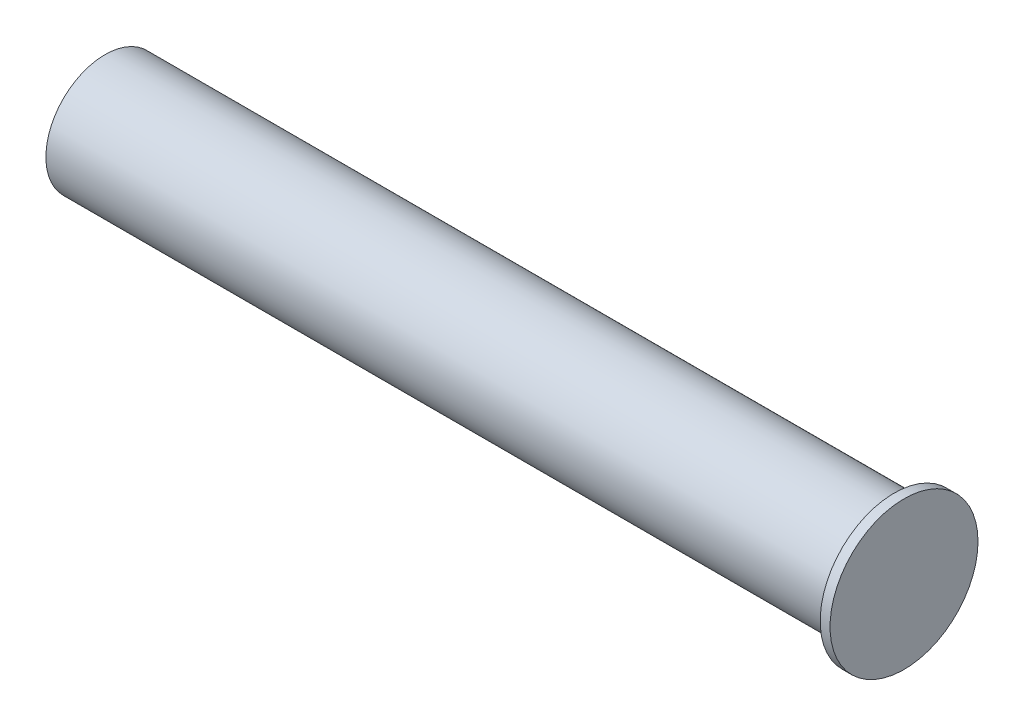
ISO-10303-21;
HEADER;
FILE_DESCRIPTION(('STEP AP214'),'2;1');
FILE_NAME('part.step','',(''),(''),'','','');
FILE_SCHEMA(('AUTOMOTIVE_DESIGN { 1 0 10303 214 1 1 1 1 }'));
ENDSEC;
DATA;
#1=APPLICATION_CONTEXT('core data for automotive mechanical design processes');
#2=APPLICATION_PROTOCOL_DEFINITION('international standard','automotive_design',2000,#1);
#3=PRODUCT_CONTEXT('',#1,'mechanical');
#4=PRODUCT('Part','Part','',(#3));
#5=PRODUCT_RELATED_PRODUCT_CATEGORY('part','',(#4));
#6=PRODUCT_DEFINITION_FORMATION('','',#4);
#7=PRODUCT_DEFINITION_CONTEXT('part definition',#1,'design');
#8=PRODUCT_DEFINITION('design','',#6,#7);
#9=PRODUCT_DEFINITION_SHAPE('','',#8);
#10=(LENGTH_UNIT() NAMED_UNIT(*) SI_UNIT(.MILLI.,.METRE.));
#11=(NAMED_UNIT(*) PLANE_ANGLE_UNIT() SI_UNIT($,.RADIAN.));
#12=(NAMED_UNIT(*) SI_UNIT($,.STERADIAN.) SOLID_ANGLE_UNIT());
#13=UNCERTAINTY_MEASURE_WITH_UNIT(LENGTH_MEASURE(1.E-05),#10,'distance_accuracy_value','');
#14=(GEOMETRIC_REPRESENTATION_CONTEXT(3) GLOBAL_UNCERTAINTY_ASSIGNED_CONTEXT((#13)) GLOBAL_UNIT_ASSIGNED_CONTEXT((#10,
#11,#12)) REPRESENTATION_CONTEXT('',''));
#15=CARTESIAN_POINT('',(0.,0.,0.));
#16=DIRECTION('',(0.,0.,1.));
#17=DIRECTION('',(1.,0.,0.));
#18=AXIS2_PLACEMENT_3D('',#15,#16,#17);
#19=CARTESIAN_POINT('',(80.,0.,0.));
#20=DIRECTION('',(-1.,0.,0.));
#21=DIRECTION('',(0.,0.,1.));
#22=AXIS2_PLACEMENT_3D('',#19,#20,#21);
#23=CYLINDRICAL_SURFACE('',#22,6.);
#24=CARTESIAN_POINT('',(80.,0.,0.));
#25=DIRECTION('',(1.,0.,0.));
#26=DIRECTION('',(0.,0.,-1.));
#27=AXIS2_PLACEMENT_3D('',#24,#25,#26);
#28=CIRCLE('',#27,6.);
#29=CARTESIAN_POINT('',(80.,0.,-6.));
#30=VERTEX_POINT('',#29);
#31=EDGE_CURVE('E10',#30,#30,#28,.T.);
#32=ORIENTED_EDGE('',*,*,#31,.F.);
#33=EDGE_LOOP('',(#32));
#34=FACE_BOUND('',#33,.T.);
#35=CARTESIAN_POINT('',(0.,0.,0.));
#36=DIRECTION('',(1.,0.,0.));
#37=DIRECTION('',(0.,0.,-1.));
#38=AXIS2_PLACEMENT_3D('',#35,#36,#37);
#39=CIRCLE('',#38,6.);
#40=CARTESIAN_POINT('',(0.,0.,-6.));
#41=VERTEX_POINT('',#40);
#42=EDGE_CURVE('E41',#41,#41,#39,.T.);
#43=ORIENTED_EDGE('',*,*,#42,.T.);
#44=EDGE_LOOP('',(#43));
#45=FACE_BOUND('',#44,.T.);
#46=ADVANCED_FACE('F38',(#34,#45),#23,.T.);
#47=CARTESIAN_POINT('',(0.,0.,0.));
#48=DIRECTION('',(1.,0.,0.));
#49=DIRECTION('',(0.,0.,-1.));
#50=AXIS2_PLACEMENT_3D('',#47,#48,#49);
#51=PLANE('',#50);
#52=ORIENTED_EDGE('',*,*,#42,.F.);
#53=EDGE_LOOP('',(#52));
#54=FACE_BOUND('',#53,.T.);
#55=ADVANCED_FACE('F65',(#54),#51,.F.);
#56=CARTESIAN_POINT('',(81.,0.,0.));
#57=DIRECTION('',(-1.,0.,0.));
#58=DIRECTION('',(0.,0.,1.));
#59=AXIS2_PLACEMENT_3D('',#56,#57,#58);
#60=CYLINDRICAL_SURFACE('',#59,7.5);
#61=CARTESIAN_POINT('',(81.,0.,0.));
#62=DIRECTION('',(1.,0.,0.));
#63=DIRECTION('',(0.,0.,-1.));
#64=AXIS2_PLACEMENT_3D('',#61,#62,#63);
#65=CIRCLE('',#64,7.5);
#66=CARTESIAN_POINT('',(81.,0.,-7.5));
#67=VERTEX_POINT('',#66);
#68=EDGE_CURVE('E52',#67,#67,#65,.T.);
#69=ORIENTED_EDGE('',*,*,#68,.F.);
#70=EDGE_LOOP('',(#69));
#71=FACE_BOUND('',#70,.T.);
#72=CARTESIAN_POINT('',(80.,0.,0.));
#73=DIRECTION('',(1.,0.,0.));
#74=DIRECTION('',(0.,0.,-1.));
#75=AXIS2_PLACEMENT_3D('',#72,#73,#74);
#76=CIRCLE('',#75,7.5);
#77=CARTESIAN_POINT('',(80.,0.,-7.5));
#78=VERTEX_POINT('',#77);
#79=EDGE_CURVE('E54',#78,#78,#76,.T.);
#80=ORIENTED_EDGE('',*,*,#79,.T.);
#81=EDGE_LOOP('',(#80));
#82=FACE_BOUND('',#81,.T.);
#83=ADVANCED_FACE('F62',(#71,#82),#60,.T.);
#84=CARTESIAN_POINT('',(81.,0.,0.));
#85=DIRECTION('',(1.,0.,0.));
#86=DIRECTION('',(0.,0.,-1.));
#87=AXIS2_PLACEMENT_3D('',#84,#85,#86);
#88=PLANE('',#87);
#89=ORIENTED_EDGE('',*,*,#68,.T.);
#90=EDGE_LOOP('',(#89));
#91=FACE_BOUND('',#90,.T.);
#92=ADVANCED_FACE('F60',(#91),#88,.T.);
#93=CARTESIAN_POINT('',(80.,0.,0.));
#94=DIRECTION('',(1.,0.,0.));
#95=DIRECTION('',(0.,0.,-1.));
#96=AXIS2_PLACEMENT_3D('',#93,#94,#95);
#97=PLANE('',#96);
#98=ORIENTED_EDGE('',*,*,#31,.T.);
#99=EDGE_LOOP('',(#98));
#100=FACE_BOUND('',#99,.T.);
#101=ORIENTED_EDGE('',*,*,#79,.F.);
#102=EDGE_LOOP('',(#101));
#103=FACE_BOUND('',#102,.T.);
#104=ADVANCED_FACE('F69',(#100,#103),#97,.F.);
#105=CLOSED_SHELL('',(#46,#55,#83,#92,#104));
#106=MANIFOLD_SOLID_BREP('B2',#105);
#107=ADVANCED_BREP_SHAPE_REPRESENTATION('',(#18,#106),#14);
#108=SHAPE_DEFINITION_REPRESENTATION(#9,#107);
ENDSEC;
END-ISO-10303-21;
